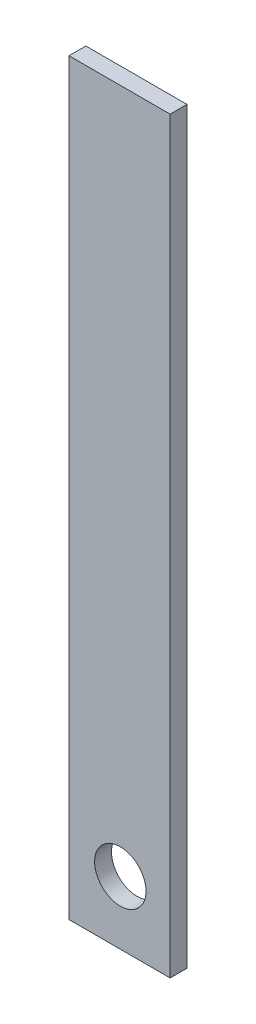
ISO-10303-21;
HEADER;
FILE_DESCRIPTION(('STEP AP214'),'2;1');
FILE_NAME('part.step','',(''),(''),'','','');
FILE_SCHEMA(('AUTOMOTIVE_DESIGN { 1 0 10303 214 1 1 1 1 }'));
ENDSEC;
DATA;
#1=APPLICATION_CONTEXT('core data for automotive mechanical design processes');
#2=APPLICATION_PROTOCOL_DEFINITION('international standard','automotive_design',2000,#1);
#3=PRODUCT_CONTEXT('',#1,'mechanical');
#4=PRODUCT('Part','Part','',(#3));
#5=PRODUCT_RELATED_PRODUCT_CATEGORY('part','',(#4));
#6=PRODUCT_DEFINITION_FORMATION('','',#4);
#7=PRODUCT_DEFINITION_CONTEXT('part definition',#1,'design');
#8=PRODUCT_DEFINITION('design','',#6,#7);
#9=PRODUCT_DEFINITION_SHAPE('','',#8);
#10=(LENGTH_UNIT() NAMED_UNIT(*) SI_UNIT(.MILLI.,.METRE.));
#11=(NAMED_UNIT(*) PLANE_ANGLE_UNIT() SI_UNIT($,.RADIAN.));
#12=(NAMED_UNIT(*) SI_UNIT($,.STERADIAN.) SOLID_ANGLE_UNIT());
#13=UNCERTAINTY_MEASURE_WITH_UNIT(LENGTH_MEASURE(1.E-05),#10,'distance_accuracy_value','');
#14=(GEOMETRIC_REPRESENTATION_CONTEXT(3) GLOBAL_UNCERTAINTY_ASSIGNED_CONTEXT((#13)) GLOBAL_UNIT_ASSIGNED_CONTEXT((#10,
#11,#12)) REPRESENTATION_CONTEXT('',''));
#15=CARTESIAN_POINT('',(0.,0.,0.));
#16=DIRECTION('',(0.,0.,1.));
#17=DIRECTION('',(1.,0.,0.));
#18=AXIS2_PLACEMENT_3D('',#15,#16,#17);
#19=CARTESIAN_POINT('',(0.,0.,2.));
#20=DIRECTION('',(0.,0.,-1.));
#21=DIRECTION('',(-1.,0.,0.));
#22=AXIS2_PLACEMENT_3D('',#19,#20,#21);
#23=PLANE('',#22);
#24=DIRECTION('',(-1.,0.,0.));
#25=VECTOR('',#24,1.);
#26=CARTESIAN_POINT('',(-91.1197968321345,-273.842864412752,2.));
#27=LINE('',#26,#25);
#28=CARTESIAN_POINT('',(-91.1197968321345,-273.842864412752,2.));
#29=VERTEX_POINT('',#28);
#30=CARTESIAN_POINT('',(-103.119796832134,-273.842864412752,2.));
#31=VERTEX_POINT('',#30);
#32=EDGE_CURVE('E106',#29,#31,#27,.T.);
#33=ORIENTED_EDGE('',*,*,#32,.F.);
#34=DIRECTION('',(0.,-1.,0.));
#35=VECTOR('',#34,1.);
#36=CARTESIAN_POINT('',(-91.1197968321345,-185.078824121015,2.));
#37=LINE('',#36,#35);
#38=CARTESIAN_POINT('',(-91.1197968321345,-185.078824121015,2.));
#39=VERTEX_POINT('',#38);
#40=EDGE_CURVE('E103',#39,#29,#37,.T.);
#41=ORIENTED_EDGE('',*,*,#40,.F.);
#42=DIRECTION('',(1.,0.,0.));
#43=VECTOR('',#42,1.);
#44=CARTESIAN_POINT('',(-103.119796832135,-185.078824121015,2.));
#45=LINE('',#44,#43);
#46=CARTESIAN_POINT('',(-103.119796832135,-185.078824121015,2.));
#47=VERTEX_POINT('',#46);
#48=EDGE_CURVE('E96',#47,#39,#45,.T.);
#49=ORIENTED_EDGE('',*,*,#48,.F.);
#50=DIRECTION('',(0.,1.,0.));
#51=VECTOR('',#50,1.);
#52=CARTESIAN_POINT('',(-103.119796832134,-273.842864412752,2.));
#53=LINE('',#52,#51);
#54=EDGE_CURVE('E102',#31,#47,#53,.T.);
#55=ORIENTED_EDGE('',*,*,#54,.F.);
#56=EDGE_LOOP('',(#33,#41,#49,#55));
#57=FACE_BOUND('',#56,.T.);
#58=CARTESIAN_POINT('',(-97.0336167523827,-266.365749924534,2.));
#59=DIRECTION('',(0.,0.,1.));
#60=DIRECTION('',(1.,0.,0.));
#61=AXIS2_PLACEMENT_3D('',#58,#59,#60);
#62=CIRCLE('',#61,3.0500000346114);
#63=CARTESIAN_POINT('',(-93.9836167177713,-266.365749924534,2.));
#64=VERTEX_POINT('',#63);
#65=EDGE_CURVE('E117',#64,#64,#62,.T.);
#66=ORIENTED_EDGE('',*,*,#65,.F.);
#67=EDGE_LOOP('',(#66));
#68=FACE_BOUND('',#67,.T.);
#69=ADVANCED_FACE('F47',(#57,#68),#23,.F.);
#70=CARTESIAN_POINT('',(0.,0.,0.));
#71=DIRECTION('',(0.,0.,-1.));
#72=DIRECTION('',(-1.,0.,0.));
#73=AXIS2_PLACEMENT_3D('',#70,#71,#72);
#74=PLANE('',#73);
#75=DIRECTION('',(-1.,0.,0.));
#76=VECTOR('',#75,1.);
#77=CARTESIAN_POINT('',(-91.1197968321345,-273.842864412752,0.));
#78=LINE('',#77,#76);
#79=CARTESIAN_POINT('',(-91.1197968321345,-273.842864412752,0.));
#80=VERTEX_POINT('',#79);
#81=CARTESIAN_POINT('',(-103.119796832134,-273.842864412752,0.));
#82=VERTEX_POINT('',#81);
#83=EDGE_CURVE('E113',#80,#82,#78,.T.);
#84=ORIENTED_EDGE('',*,*,#83,.T.);
#85=DIRECTION('',(0.,1.,0.));
#86=VECTOR('',#85,1.);
#87=CARTESIAN_POINT('',(-103.119796832134,-273.842864412752,0.));
#88=LINE('',#87,#86);
#89=CARTESIAN_POINT('',(-103.119796832135,-185.078824121015,0.));
#90=VERTEX_POINT('',#89);
#91=EDGE_CURVE('E116',#82,#90,#88,.T.);
#92=ORIENTED_EDGE('',*,*,#91,.T.);
#93=DIRECTION('',(1.,0.,0.));
#94=VECTOR('',#93,1.);
#95=CARTESIAN_POINT('',(-103.119796832135,-185.078824121015,0.));
#96=LINE('',#95,#94);
#97=CARTESIAN_POINT('',(-91.1197968321345,-185.078824121015,0.));
#98=VERTEX_POINT('',#97);
#99=EDGE_CURVE('E98',#90,#98,#96,.T.);
#100=ORIENTED_EDGE('',*,*,#99,.T.);
#101=DIRECTION('',(0.,-1.,0.));
#102=VECTOR('',#101,1.);
#103=CARTESIAN_POINT('',(-91.1197968321345,-185.078824121015,0.));
#104=LINE('',#103,#102);
#105=EDGE_CURVE('E108',#98,#80,#104,.T.);
#106=ORIENTED_EDGE('',*,*,#105,.T.);
#107=EDGE_LOOP('',(#84,#92,#100,#106));
#108=FACE_BOUND('',#107,.T.);
#109=CARTESIAN_POINT('',(-97.0336167523827,-266.365749924534,0.));
#110=DIRECTION('',(0.,0.,1.));
#111=DIRECTION('',(1.,0.,0.));
#112=AXIS2_PLACEMENT_3D('',#109,#110,#111);
#113=CIRCLE('',#112,3.0500000346114);
#114=CARTESIAN_POINT('',(-93.9836167177713,-266.365749924534,0.));
#115=VERTEX_POINT('',#114);
#116=EDGE_CURVE('E151',#115,#115,#113,.T.);
#117=ORIENTED_EDGE('',*,*,#116,.T.);
#118=EDGE_LOOP('',(#117));
#119=FACE_BOUND('',#118,.T.);
#120=ADVANCED_FACE('F123',(#108,#119),#74,.T.);
#121=CARTESIAN_POINT('',(-91.1197968321345,-273.842864412752,2.));
#122=DIRECTION('',(0.,-1.,0.));
#123=DIRECTION('',(0.,0.,-1.));
#124=AXIS2_PLACEMENT_3D('',#121,#122,#123);
#125=PLANE('',#124);
#126=ORIENTED_EDGE('',*,*,#83,.F.);
#127=DIRECTION('',(0.,0.,-1.));
#128=VECTOR('',#127,1.);
#129=CARTESIAN_POINT('',(-91.1197968321345,-273.842864412752,2.));
#130=LINE('',#129,#128);
#131=EDGE_CURVE('E12',#29,#80,#130,.T.);
#132=ORIENTED_EDGE('',*,*,#131,.F.);
#133=ORIENTED_EDGE('',*,*,#32,.T.);
#134=DIRECTION('',(0.,0.,-1.));
#135=VECTOR('',#134,1.);
#136=CARTESIAN_POINT('',(-103.119796832134,-273.842864412752,2.));
#137=LINE('',#136,#135);
#138=EDGE_CURVE('E51',#31,#82,#137,.T.);
#139=ORIENTED_EDGE('',*,*,#138,.T.);
#140=EDGE_LOOP('',(#126,#132,#133,#139));
#141=FACE_BOUND('',#140,.T.);
#142=ADVANCED_FACE('F49',(#141),#125,.T.);
#143=CARTESIAN_POINT('',(-91.1197968321345,-185.078824121015,2.));
#144=DIRECTION('',(1.,0.,0.));
#145=DIRECTION('',(0.,0.,-1.));
#146=AXIS2_PLACEMENT_3D('',#143,#144,#145);
#147=PLANE('',#146);
#148=ORIENTED_EDGE('',*,*,#105,.F.);
#149=DIRECTION('',(0.,0.,-1.));
#150=VECTOR('',#149,1.);
#151=CARTESIAN_POINT('',(-91.1197968321345,-185.078824121015,2.));
#152=LINE('',#151,#150);
#153=EDGE_CURVE('E57',#39,#98,#152,.T.);
#154=ORIENTED_EDGE('',*,*,#153,.F.);
#155=ORIENTED_EDGE('',*,*,#40,.T.);
#156=ORIENTED_EDGE('',*,*,#131,.T.);
#157=EDGE_LOOP('',(#148,#154,#155,#156));
#158=FACE_BOUND('',#157,.T.);
#159=ADVANCED_FACE('F125',(#158),#147,.T.);
#160=CARTESIAN_POINT('',(-103.119796832135,-185.078824121015,2.));
#161=DIRECTION('',(0.,1.,0.));
#162=DIRECTION('',(0.,0.,1.));
#163=AXIS2_PLACEMENT_3D('',#160,#161,#162);
#164=PLANE('',#163);
#165=ORIENTED_EDGE('',*,*,#99,.F.);
#166=DIRECTION('',(0.,0.,-1.));
#167=VECTOR('',#166,1.);
#168=CARTESIAN_POINT('',(-103.119796832135,-185.078824121015,2.));
#169=LINE('',#168,#167);
#170=EDGE_CURVE('E93',#47,#90,#169,.T.);
#171=ORIENTED_EDGE('',*,*,#170,.F.);
#172=ORIENTED_EDGE('',*,*,#48,.T.);
#173=ORIENTED_EDGE('',*,*,#153,.T.);
#174=EDGE_LOOP('',(#165,#171,#172,#173));
#175=FACE_BOUND('',#174,.T.);
#176=ADVANCED_FACE('F95',(#175),#164,.T.);
#177=CARTESIAN_POINT('',(-103.119796832134,-273.842864412752,2.));
#178=DIRECTION('',(-1.,0.,0.));
#179=DIRECTION('',(0.,-1.,0.));
#180=AXIS2_PLACEMENT_3D('',#177,#178,#179);
#181=PLANE('',#180);
#182=ORIENTED_EDGE('',*,*,#91,.F.);
#183=ORIENTED_EDGE('',*,*,#138,.F.);
#184=ORIENTED_EDGE('',*,*,#54,.T.);
#185=ORIENTED_EDGE('',*,*,#170,.T.);
#186=EDGE_LOOP('',(#182,#183,#184,#185));
#187=FACE_BOUND('',#186,.T.);
#188=ADVANCED_FACE('F105',(#187),#181,.T.);
#189=CARTESIAN_POINT('',(-97.0336167523827,-266.365749924534,2.));
#190=DIRECTION('',(0.,0.,-1.));
#191=DIRECTION('',(-1.,0.,0.));
#192=AXIS2_PLACEMENT_3D('',#189,#190,#191);
#193=CYLINDRICAL_SURFACE('',#192,3.0500000346114);
#194=ORIENTED_EDGE('',*,*,#65,.T.);
#195=EDGE_LOOP('',(#194));
#196=FACE_BOUND('',#195,.T.);
#197=ORIENTED_EDGE('',*,*,#116,.F.);
#198=EDGE_LOOP('',(#197));
#199=FACE_BOUND('',#198,.T.);
#200=ADVANCED_FACE('F140',(#196,#199),#193,.F.);
#201=CLOSED_SHELL('',(#69,#120,#142,#159,#176,#188,#200));
#202=MANIFOLD_SOLID_BREP('B2',#201);
#203=ADVANCED_BREP_SHAPE_REPRESENTATION('',(#18,#202),#14);
#204=SHAPE_DEFINITION_REPRESENTATION(#9,#203);
ENDSEC;
END-ISO-10303-21;
